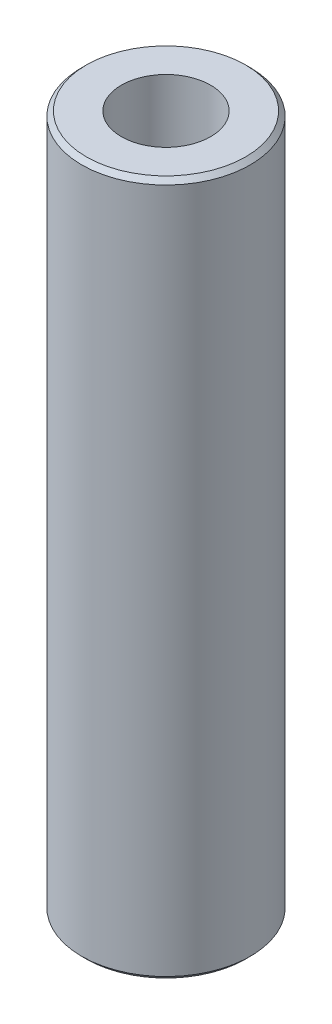
ISO-10303-21;
HEADER;
FILE_DESCRIPTION(('STEP AP214'),'2;1');
FILE_NAME('part.step','',(''),(''),'','','');
FILE_SCHEMA(('AUTOMOTIVE_DESIGN { 1 0 10303 214 1 1 1 1 }'));
ENDSEC;
DATA;
#1=APPLICATION_CONTEXT('core data for automotive mechanical design processes');
#2=APPLICATION_PROTOCOL_DEFINITION('international standard','automotive_design',2000,#1);
#3=PRODUCT_CONTEXT('',#1,'mechanical');
#4=PRODUCT('Part','Part','',(#3));
#5=PRODUCT_RELATED_PRODUCT_CATEGORY('part','',(#4));
#6=PRODUCT_DEFINITION_FORMATION('','',#4);
#7=PRODUCT_DEFINITION_CONTEXT('part definition',#1,'design');
#8=PRODUCT_DEFINITION('design','',#6,#7);
#9=PRODUCT_DEFINITION_SHAPE('','',#8);
#10=(LENGTH_UNIT() NAMED_UNIT(*) SI_UNIT(.MILLI.,.METRE.));
#11=(NAMED_UNIT(*) PLANE_ANGLE_UNIT() SI_UNIT($,.RADIAN.));
#12=(NAMED_UNIT(*) SI_UNIT($,.STERADIAN.) SOLID_ANGLE_UNIT());
#13=UNCERTAINTY_MEASURE_WITH_UNIT(LENGTH_MEASURE(1.E-05),#10,'distance_accuracy_value','');
#14=(GEOMETRIC_REPRESENTATION_CONTEXT(3) GLOBAL_UNCERTAINTY_ASSIGNED_CONTEXT((#13)) GLOBAL_UNIT_ASSIGNED_CONTEXT((#10,
#11,#12)) REPRESENTATION_CONTEXT('',''));
#15=CARTESIAN_POINT('',(0.,0.,0.));
#16=DIRECTION('',(0.,0.,1.));
#17=DIRECTION('',(1.,0.,0.));
#18=AXIS2_PLACEMENT_3D('',#15,#16,#17);
#19=CARTESIAN_POINT('',(0.,247.301971470181,0.));
#20=DIRECTION('',(0.,-1.,0.));
#21=DIRECTION('',(0.,0.,-1.));
#22=AXIS2_PLACEMENT_3D('',#19,#20,#21);
#23=CYLINDRICAL_SURFACE('',#22,30.);
#24=CARTESIAN_POINT('',(0.,245.654634463996,0.));
#25=DIRECTION('',(0.,1.,0.));
#26=DIRECTION('',(0.,0.,1.));
#27=AXIS2_PLACEMENT_3D('',#24,#25,#26);
#28=CIRCLE('',#27,30.);
#29=CARTESIAN_POINT('',(0.,245.654634463996,30.));
#30=VERTEX_POINT('',#29);
#31=EDGE_CURVE('E50',#30,#30,#28,.F.);
#32=ORIENTED_EDGE('',*,*,#31,.T.);
#33=EDGE_LOOP('',(#32));
#34=FACE_BOUND('',#33,.T.);
#35=CARTESIAN_POINT('',(0.,1.64733700618458,0.));
#36=DIRECTION('',(0.,1.,0.));
#37=DIRECTION('',(0.,0.,1.));
#38=AXIS2_PLACEMENT_3D('',#35,#36,#37);
#39=CIRCLE('',#38,30.);
#40=CARTESIAN_POINT('',(0.,1.64733700618458,30.));
#41=VERTEX_POINT('',#40);
#42=EDGE_CURVE('E51',#41,#41,#39,.T.);
#43=ORIENTED_EDGE('',*,*,#42,.T.);
#44=EDGE_LOOP('',(#43));
#45=FACE_BOUND('',#44,.T.);
#46=ADVANCED_FACE('F39',(#34,#45),#23,.T.);
#47=CARTESIAN_POINT('',(0.,247.301971470181,0.));
#48=DIRECTION('',(0.,1.,0.));
#49=DIRECTION('',(0.,0.,1.));
#50=AXIS2_PLACEMENT_3D('',#47,#48,#49);
#51=PLANE('',#50);
#52=CARTESIAN_POINT('',(0.,247.301971470181,0.));
#53=DIRECTION('',(0.,1.,0.));
#54=DIRECTION('',(0.,0.,1.));
#55=AXIS2_PLACEMENT_3D('',#52,#53,#54);
#56=CIRCLE('',#55,28.3526629938155);
#57=CARTESIAN_POINT('',(0.,247.301971470181,28.3526629938155));
#58=VERTEX_POINT('',#57);
#59=EDGE_CURVE('E54',#58,#58,#56,.T.);
#60=ORIENTED_EDGE('',*,*,#59,.T.);
#61=EDGE_LOOP('',(#60));
#62=FACE_BOUND('',#61,.T.);
#63=CARTESIAN_POINT('',(0.,247.301971470181,0.));
#64=DIRECTION('',(0.,1.,0.));
#65=DIRECTION('',(0.,0.,1.));
#66=AXIS2_PLACEMENT_3D('',#63,#64,#65);
#67=CIRCLE('',#66,15.9033828928429);
#68=CARTESIAN_POINT('',(0.,247.301971470181,15.9033828928429));
#69=VERTEX_POINT('',#68);
#70=EDGE_CURVE('E58',#69,#69,#67,.T.);
#71=ORIENTED_EDGE('',*,*,#70,.F.);
#72=EDGE_LOOP('',(#71));
#73=FACE_BOUND('',#72,.T.);
#74=ADVANCED_FACE('F69',(#62,#73),#51,.T.);
#75=CARTESIAN_POINT('',(0.,0.,0.));
#76=DIRECTION('',(0.,1.,0.));
#77=DIRECTION('',(0.,0.,1.));
#78=AXIS2_PLACEMENT_3D('',#75,#76,#77);
#79=PLANE('',#78);
#80=CARTESIAN_POINT('',(0.,0.,0.));
#81=DIRECTION('',(0.,1.,0.));
#82=DIRECTION('',(0.,0.,1.));
#83=AXIS2_PLACEMENT_3D('',#80,#81,#82);
#84=CIRCLE('',#83,28.3526629938154);
#85=CARTESIAN_POINT('',(0.,0.,28.3526629938154));
#86=VERTEX_POINT('',#85);
#87=EDGE_CURVE('E10',#86,#86,#84,.F.);
#88=ORIENTED_EDGE('',*,*,#87,.T.);
#89=EDGE_LOOP('',(#88));
#90=FACE_BOUND('',#89,.T.);
#91=CARTESIAN_POINT('',(0.,0.,0.));
#92=DIRECTION('',(0.,1.,0.));
#93=DIRECTION('',(0.,0.,1.));
#94=AXIS2_PLACEMENT_3D('',#91,#92,#93);
#95=CIRCLE('',#94,15.9033828928429);
#96=CARTESIAN_POINT('',(0.,0.,15.9033828928429));
#97=VERTEX_POINT('',#96);
#98=EDGE_CURVE('E63',#97,#97,#95,.T.);
#99=ORIENTED_EDGE('',*,*,#98,.T.);
#100=EDGE_LOOP('',(#99));
#101=FACE_BOUND('',#100,.T.);
#102=ADVANCED_FACE('F75',(#90,#101),#79,.F.);
#103=CARTESIAN_POINT('',(0.,247.301971470181,0.));
#104=DIRECTION('',(0.,-1.,0.));
#105=DIRECTION('',(0.,0.,-1.));
#106=AXIS2_PLACEMENT_3D('',#103,#104,#105);
#107=CYLINDRICAL_SURFACE('',#106,15.9033828928429);
#108=ORIENTED_EDGE('',*,*,#70,.T.);
#109=EDGE_LOOP('',(#108));
#110=FACE_BOUND('',#109,.T.);
#111=ORIENTED_EDGE('',*,*,#98,.F.);
#112=EDGE_LOOP('',(#111));
#113=FACE_BOUND('',#112,.T.);
#114=ADVANCED_FACE('F70',(#110,#113),#107,.F.);
#115=CARTESIAN_POINT('',(0.,247.301971470181,0.));
#116=DIRECTION('',(0.,-1.,0.));
#117=DIRECTION('',(0.,0.,-1.));
#118=AXIS2_PLACEMENT_3D('',#115,#116,#117);
#119=CONICAL_SURFACE('',#118,28.3526629938155,0.785398163397457);
#120=ORIENTED_EDGE('',*,*,#31,.F.);
#121=EDGE_LOOP('',(#120));
#122=FACE_BOUND('',#121,.T.);
#123=ORIENTED_EDGE('',*,*,#59,.F.);
#124=EDGE_LOOP('',(#123));
#125=FACE_BOUND('',#124,.T.);
#126=ADVANCED_FACE('F81',(#122,#125),#119,.T.);
#127=CARTESIAN_POINT('',(0.,1.64733700618458,0.));
#128=DIRECTION('',(0.,1.,0.));
#129=DIRECTION('',(0.,0.,1.));
#130=AXIS2_PLACEMENT_3D('',#127,#128,#129);
#131=CONICAL_SURFACE('',#130,30.,0.785398163397457);
#132=CARTESIAN_POINT('',(0.,0.,28.3526629938154));
#133=CARTESIAN_POINT('',(0.,0.0171597604810887,28.3698227542965));
#134=CARTESIAN_POINT('',(0.,0.0343195209621783,28.3869825147776));
#135=CARTESIAN_POINT('',(0.,0.0686390419243574,28.4213020357397));
#136=CARTESIAN_POINT('',(0.,0.085798802405447,28.4384617962208));
#137=CARTESIAN_POINT('',(0.,0.120118323367626,28.472781317183));
#138=CARTESIAN_POINT('',(0.,0.137278083848714,28.4899410776641));
#139=CARTESIAN_POINT('',(0.,0.171597604810893,28.5242605986263));
#140=CARTESIAN_POINT('',(0.,0.188757365291983,28.5414203591074));
#141=CARTESIAN_POINT('',(0.,0.223076886254162,28.5757398800696));
#142=CARTESIAN_POINT('',(0.,0.240236646735251,28.5928996405506));
#143=CARTESIAN_POINT('',(0.,0.27455616769743,28.6272191615128));
#144=CARTESIAN_POINT('',(0.,0.291715928178519,28.6443789219939));
#145=CARTESIAN_POINT('',(0.,0.326035449140698,28.6786984429561));
#146=CARTESIAN_POINT('',(0.,0.343195209621787,28.6958582034372));
#147=CARTESIAN_POINT('',(0.,0.377514730583966,28.7301777243994));
#148=CARTESIAN_POINT('',(0.,0.394674491065055,28.7473374848805));
#149=CARTESIAN_POINT('',(0.,0.428994012027234,28.7816570058426));
#150=CARTESIAN_POINT('',(0.,0.446153772508323,28.7988167663237));
#151=CARTESIAN_POINT('',(0.,0.480473293470502,28.8331362872859));
#152=CARTESIAN_POINT('',(0.,0.497633053951592,28.850296047767));
#153=CARTESIAN_POINT('',(0.,0.53195257491377,28.8846155687292));
#154=CARTESIAN_POINT('',(0.,0.549112335394859,28.9017753292103));
#155=CARTESIAN_POINT('',(0.,0.583431856357038,28.9360948501724));
#156=CARTESIAN_POINT('',(0.,0.600591616838128,28.9532546106535));
#157=CARTESIAN_POINT('',(0.,0.634911137800307,28.9875741316157));
#158=CARTESIAN_POINT('',(0.,0.652070898281396,29.0047338920968));
#159=CARTESIAN_POINT('',(0.,0.686390419243575,29.039053413059));
#160=CARTESIAN_POINT('',(0.,0.703550179724664,29.0562131735401));
#161=CARTESIAN_POINT('',(0.,0.737869700686843,29.0905326945022));
#162=CARTESIAN_POINT('',(0.,0.755029461167932,29.1076924549833));
#163=CARTESIAN_POINT('',(0.,0.78934898213011,29.1420119759455));
#164=CARTESIAN_POINT('',(0.,0.8065087426112,29.1591717364266));
#165=CARTESIAN_POINT('',(0.,0.840828263573379,29.1934912573888));
#166=CARTESIAN_POINT('',(0.,0.857988024054468,29.2106510178699));
#167=CARTESIAN_POINT('',(0.,0.892307545016647,29.2449705388321));
#168=CARTESIAN_POINT('',(0.,0.909467305497737,29.2621302993131));
#169=CARTESIAN_POINT('',(0.,0.943786826459915,29.2964498202753));
#170=CARTESIAN_POINT('',(0.,0.960946586941004,29.3136095807564));
#171=CARTESIAN_POINT('',(0.,0.995266107903183,29.3479291017186));
#172=CARTESIAN_POINT('',(0.,1.01242586838427,29.3650888621997));
#173=CARTESIAN_POINT('',(0.,1.04674538934645,29.3994083831619));
#174=CARTESIAN_POINT('',(0.,1.06390514982754,29.4165681436429));
#175=CARTESIAN_POINT('',(0.,1.09822467078972,29.4508876646051));
#176=CARTESIAN_POINT('',(0.,1.11538443127081,29.4680474250862));
#177=CARTESIAN_POINT('',(0.,1.14970395223299,29.5023669460484));
#178=CARTESIAN_POINT('',(0.,1.16686371271408,29.5195267065295));
#179=CARTESIAN_POINT('',(0.,1.20118323367626,29.5538462274917));
#180=CARTESIAN_POINT('',(0.,1.21834299415734,29.5710059879728));
#181=CARTESIAN_POINT('',(0.,1.25266251511952,29.6053255089349));
#182=CARTESIAN_POINT('',(0.,1.26982227560061,29.622485269416));
#183=CARTESIAN_POINT('',(0.,1.30414179656279,29.6568047903782));
#184=CARTESIAN_POINT('',(0.,1.32130155704388,29.6739645508593));
#185=CARTESIAN_POINT('',(0.,1.35562107800606,29.7082840718215));
#186=CARTESIAN_POINT('',(0.,1.37278083848715,29.7254438323026));
#187=CARTESIAN_POINT('',(0.,1.40710035944933,29.7597633532647));
#188=CARTESIAN_POINT('',(0.,1.42426011993042,29.7769231137458));
#189=CARTESIAN_POINT('',(0.,1.4585796408926,29.811242634708));
#190=CARTESIAN_POINT('',(0.,1.47573940137369,29.8284023951891));
#191=CARTESIAN_POINT('',(0.,1.51005892233586,29.8627219161513));
#192=CARTESIAN_POINT('',(0.,1.52721868281695,29.8798816766324));
#193=CARTESIAN_POINT('',(0.,1.56153820377913,29.9142011975946));
#194=CARTESIAN_POINT('',(0.,1.57869796426022,29.9313609580756));
#195=CARTESIAN_POINT('',(0.,1.6130174852224,29.9656804790378));
#196=CARTESIAN_POINT('',(0.,1.63017724570349,29.9828402395189));
#197=CARTESIAN_POINT('',(0.,1.64733700618458,30.));
#198=B_SPLINE_CURVE_WITH_KNOTS('',3,(#132,#133,#134,#135,#136,#137,#138,#139,#140,#141,#142,
#143,#144,#145,#146,#147,#148,#149,#150,#151,#152,#153,#154,#155,#156,#157,#158,#159,#160,#161,
#162,#163,#164,#165,#166,#167,#168,#169,#170,#171,#172,#173,#174,#175,#176,#177,#178,#179,#180,
#181,#182,#183,#184,#185,#186,#187,#188,#189,#190,#191,#192,#193,#194,#195,#196,#197),
.UNSPECIFIED.,.F.,.F.,(4,2,2,2,2,2,2,2,2,2,2,2,2,2,2,2,2,2,2,2,2,2,2,2,2,2,2,2,2,2,2,2,4),(0.,
0.0728026979982914,0.145605395996583,0.218408093994877,0.291210791993168,0.364013489991459,
0.436816187989751,0.509618885988044,0.582421583986336,0.655224281984627,0.728026979982919,
0.800829677981212,0.873632375979504,0.946435073977795,1.01923777197609,1.09204046997438,
1.16484316797267,1.23764586597096,1.31044856396925,1.38325126196755,1.45605395996584,
1.52885665796413,1.60165935596242,1.67446205396072,1.74726475195901,1.8200674499573,
1.89287014795559,1.96567284595388,2.03847554395218,2.11127824195047,2.18408093994876,
2.25688363794705,2.32968633594534),.UNSPECIFIED.);
#199=EDGE_CURVE('BSEAM45',#86,#41,#198,.T.);
#200=ORIENTED_EDGE('',*,*,#87,.F.);
#201=ORIENTED_EDGE('',*,*,#42,.F.);
#202=ORIENTED_EDGE('',*,*,#199,.T.);
#203=ORIENTED_EDGE('',*,*,#199,.F.);
#204=EDGE_LOOP('',(#200,#202,#201,#203));
#205=FACE_BOUND('',#204,.T.);
#206=ADVANCED_FACE('F45',(#205),#131,.T.);
#207=CLOSED_SHELL('',(#46,#74,#102,#114,#126,#206));
#208=MANIFOLD_SOLID_BREP('B2',#207);
#209=ADVANCED_BREP_SHAPE_REPRESENTATION('',(#18,#208),#14);
#210=SHAPE_DEFINITION_REPRESENTATION(#9,#209);
ENDSEC;
END-ISO-10303-21;
